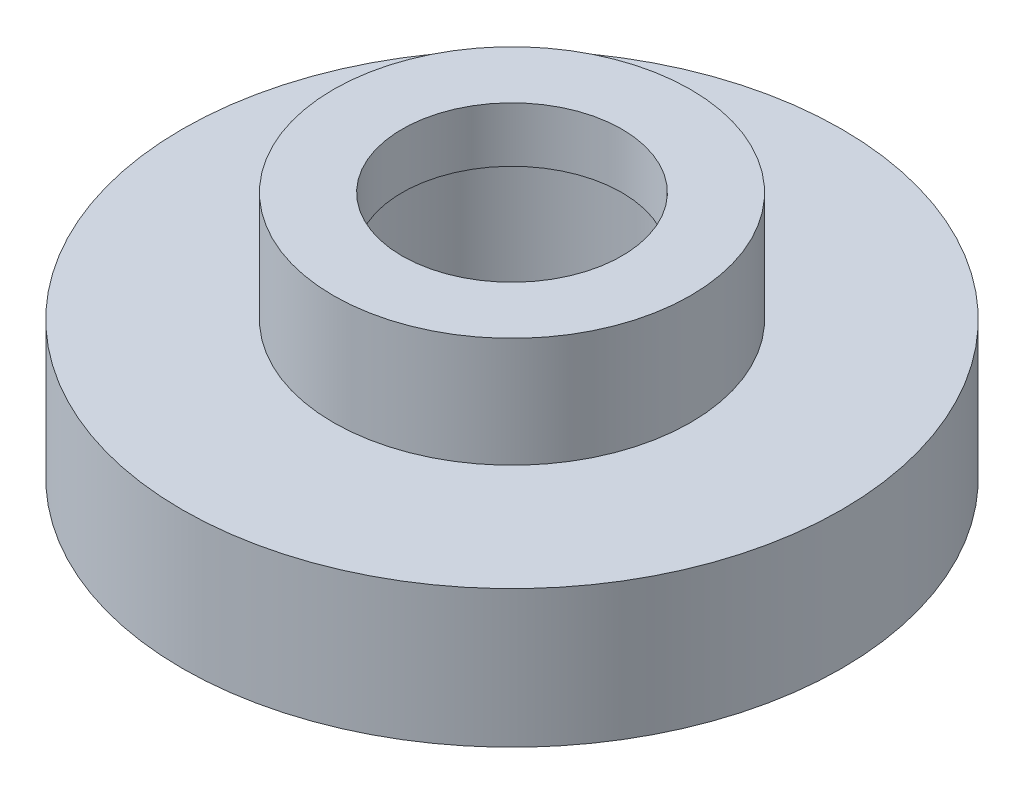
ISO-10303-21;
HEADER;
FILE_DESCRIPTION(('STEP AP214'),'2;1');
FILE_NAME('part.step','',(''),(''),'','','');
FILE_SCHEMA(('AUTOMOTIVE_DESIGN { 1 0 10303 214 1 1 1 1 }'));
ENDSEC;
DATA;
#1=APPLICATION_CONTEXT('core data for automotive mechanical design processes');
#2=APPLICATION_PROTOCOL_DEFINITION('international standard','automotive_design',2000,#1);
#3=PRODUCT_CONTEXT('',#1,'mechanical');
#4=PRODUCT('Part','Part','',(#3));
#5=PRODUCT_RELATED_PRODUCT_CATEGORY('part','',(#4));
#6=PRODUCT_DEFINITION_FORMATION('','',#4);
#7=PRODUCT_DEFINITION_CONTEXT('part definition',#1,'design');
#8=PRODUCT_DEFINITION('design','',#6,#7);
#9=PRODUCT_DEFINITION_SHAPE('','',#8);
#10=(LENGTH_UNIT() NAMED_UNIT(*) SI_UNIT(.MILLI.,.METRE.));
#11=(NAMED_UNIT(*) PLANE_ANGLE_UNIT() SI_UNIT($,.RADIAN.));
#12=(NAMED_UNIT(*) SI_UNIT($,.STERADIAN.) SOLID_ANGLE_UNIT());
#13=UNCERTAINTY_MEASURE_WITH_UNIT(LENGTH_MEASURE(1.E-05),#10,'distance_accuracy_value','');
#14=(GEOMETRIC_REPRESENTATION_CONTEXT(3) GLOBAL_UNCERTAINTY_ASSIGNED_CONTEXT((#13)) GLOBAL_UNIT_ASSIGNED_CONTEXT((#10,
#11,#12)) REPRESENTATION_CONTEXT('',''));
#15=CARTESIAN_POINT('',(0.,0.,0.));
#16=DIRECTION('',(0.,0.,1.));
#17=DIRECTION('',(1.,0.,0.));
#18=AXIS2_PLACEMENT_3D('',#15,#16,#17);
#19=CARTESIAN_POINT('',(0.,5.,0.));
#20=DIRECTION('',(0.,-1.,0.));
#21=DIRECTION('',(0.,0.,-1.));
#22=AXIS2_PLACEMENT_3D('',#19,#20,#21);
#23=CYLINDRICAL_SURFACE('',#22,12.);
#24=CARTESIAN_POINT('',(0.,5.,0.));
#25=DIRECTION('',(0.,1.,0.));
#26=DIRECTION('',(0.,0.,1.));
#27=AXIS2_PLACEMENT_3D('',#24,#25,#26);
#28=CIRCLE('',#27,12.);
#29=CARTESIAN_POINT('',(0.,5.,12.));
#30=VERTEX_POINT('',#29);
#31=EDGE_CURVE('E41',#30,#30,#28,.T.);
#32=ORIENTED_EDGE('',*,*,#31,.F.);
#33=EDGE_LOOP('',(#32));
#34=FACE_BOUND('',#33,.T.);
#35=CARTESIAN_POINT('',(0.,0.,0.));
#36=DIRECTION('',(0.,1.,0.));
#37=DIRECTION('',(0.,0.,1.));
#38=AXIS2_PLACEMENT_3D('',#35,#36,#37);
#39=CIRCLE('',#38,12.);
#40=CARTESIAN_POINT('',(0.,0.,12.));
#41=VERTEX_POINT('',#40);
#42=EDGE_CURVE('E46',#41,#41,#39,.T.);
#43=ORIENTED_EDGE('',*,*,#42,.T.);
#44=EDGE_LOOP('',(#43));
#45=FACE_BOUND('',#44,.T.);
#46=ADVANCED_FACE('F34',(#34,#45),#23,.T.);
#47=CARTESIAN_POINT('',(0.,5.,0.));
#48=DIRECTION('',(0.,1.,0.));
#49=DIRECTION('',(0.,0.,1.));
#50=AXIS2_PLACEMENT_3D('',#47,#48,#49);
#51=PLANE('',#50);
#52=CARTESIAN_POINT('',(0.,5.,0.));
#53=DIRECTION('',(0.,1.,0.));
#54=DIRECTION('',(0.,0.,1.));
#55=AXIS2_PLACEMENT_3D('',#52,#53,#54);
#56=CIRCLE('',#55,6.5);
#57=CARTESIAN_POINT('',(0.,5.,6.5));
#58=VERTEX_POINT('',#57);
#59=EDGE_CURVE('E10',#58,#58,#56,.T.);
#60=ORIENTED_EDGE('',*,*,#59,.F.);
#61=EDGE_LOOP('',(#60));
#62=FACE_BOUND('',#61,.T.);
#63=ORIENTED_EDGE('',*,*,#31,.T.);
#64=EDGE_LOOP('',(#63));
#65=FACE_BOUND('',#64,.T.);
#66=ADVANCED_FACE('F87',(#62,#65),#51,.T.);
#67=CARTESIAN_POINT('',(0.,0.,0.));
#68=DIRECTION('',(0.,1.,0.));
#69=DIRECTION('',(0.,0.,1.));
#70=AXIS2_PLACEMENT_3D('',#67,#68,#69);
#71=PLANE('',#70);
#72=CARTESIAN_POINT('',(0.,0.,0.));
#73=DIRECTION('',(0.,-1.,0.));
#74=DIRECTION('',(0.,0.,-1.));
#75=AXIS2_PLACEMENT_3D('',#72,#73,#74);
#76=CIRCLE('',#75,5.1);
#77=CARTESIAN_POINT('',(0.,0.,-5.1));
#78=VERTEX_POINT('',#77);
#79=EDGE_CURVE('E59',#78,#78,#76,.T.);
#80=ORIENTED_EDGE('',*,*,#79,.F.);
#81=EDGE_LOOP('',(#80));
#82=FACE_BOUND('',#81,.T.);
#83=ORIENTED_EDGE('',*,*,#42,.F.);
#84=EDGE_LOOP('',(#83));
#85=FACE_BOUND('',#84,.T.);
#86=ADVANCED_FACE('F92',(#82,#85),#71,.F.);
#87=CARTESIAN_POINT('',(0.,9.,0.));
#88=DIRECTION('',(0.,-1.,0.));
#89=DIRECTION('',(0.,0.,-1.));
#90=AXIS2_PLACEMENT_3D('',#87,#88,#89);
#91=CYLINDRICAL_SURFACE('',#90,6.5);
#92=CARTESIAN_POINT('',(0.,9.,0.));
#93=DIRECTION('',(0.,1.,0.));
#94=DIRECTION('',(0.,0.,1.));
#95=AXIS2_PLACEMENT_3D('',#92,#93,#94);
#96=CIRCLE('',#95,6.5);
#97=CARTESIAN_POINT('',(0.,9.,6.5));
#98=VERTEX_POINT('',#97);
#99=EDGE_CURVE('E49',#98,#98,#96,.T.);
#100=ORIENTED_EDGE('',*,*,#99,.F.);
#101=EDGE_LOOP('',(#100));
#102=FACE_BOUND('',#101,.T.);
#103=ORIENTED_EDGE('',*,*,#59,.T.);
#104=EDGE_LOOP('',(#103));
#105=FACE_BOUND('',#104,.T.);
#106=ADVANCED_FACE('F100',(#102,#105),#91,.T.);
#107=CARTESIAN_POINT('',(0.,9.,0.));
#108=DIRECTION('',(0.,1.,0.));
#109=DIRECTION('',(0.,0.,1.));
#110=AXIS2_PLACEMENT_3D('',#107,#108,#109);
#111=PLANE('',#110);
#112=CARTESIAN_POINT('',(0.,9.,0.));
#113=DIRECTION('',(0.,1.,0.));
#114=DIRECTION('',(0.,0.,1.));
#115=AXIS2_PLACEMENT_3D('',#112,#113,#114);
#116=CIRCLE('',#115,4.);
#117=CARTESIAN_POINT('',(0.,9.,4.));
#118=VERTEX_POINT('',#117);
#119=EDGE_CURVE('E65',#118,#118,#116,.T.);
#120=ORIENTED_EDGE('',*,*,#119,.F.);
#121=EDGE_LOOP('',(#120));
#122=FACE_BOUND('',#121,.T.);
#123=ORIENTED_EDGE('',*,*,#99,.T.);
#124=EDGE_LOOP('',(#123));
#125=FACE_BOUND('',#124,.T.);
#126=ADVANCED_FACE('F83',(#122,#125),#111,.T.);
#127=CARTESIAN_POINT('',(0.,7.,0.));
#128=DIRECTION('',(0.,-1.,0.));
#129=DIRECTION('',(0.,0.,-1.));
#130=AXIS2_PLACEMENT_3D('',#127,#128,#129);
#131=CYLINDRICAL_SURFACE('',#130,5.1);
#132=CARTESIAN_POINT('',(0.,7.,0.));
#133=DIRECTION('',(0.,-1.,0.));
#134=DIRECTION('',(0.,0.,-1.));
#135=AXIS2_PLACEMENT_3D('',#132,#133,#134);
#136=CIRCLE('',#135,5.1);
#137=CARTESIAN_POINT('',(0.,7.,-5.1));
#138=VERTEX_POINT('',#137);
#139=EDGE_CURVE('E55',#138,#138,#136,.T.);
#140=ORIENTED_EDGE('',*,*,#139,.F.);
#141=EDGE_LOOP('',(#140));
#142=FACE_BOUND('',#141,.T.);
#143=ORIENTED_EDGE('',*,*,#79,.T.);
#144=EDGE_LOOP('',(#143));
#145=FACE_BOUND('',#144,.T.);
#146=ADVANCED_FACE('F76',(#142,#145),#131,.F.);
#147=CARTESIAN_POINT('',(0.,7.,0.));
#148=DIRECTION('',(0.,-1.,0.));
#149=DIRECTION('',(0.,0.,-1.));
#150=AXIS2_PLACEMENT_3D('',#147,#148,#149);
#151=PLANE('',#150);
#152=CARTESIAN_POINT('',(0.,7.,0.));
#153=DIRECTION('',(0.,-1.,0.));
#154=DIRECTION('',(0.,0.,-1.));
#155=AXIS2_PLACEMENT_3D('',#152,#153,#154);
#156=CIRCLE('',#155,4.);
#157=CARTESIAN_POINT('',(0.,7.,-4.));
#158=VERTEX_POINT('',#157);
#159=EDGE_CURVE('E37',#158,#158,#156,.T.);
#160=ORIENTED_EDGE('',*,*,#159,.F.);
#161=EDGE_LOOP('',(#160));
#162=FACE_BOUND('',#161,.T.);
#163=ORIENTED_EDGE('',*,*,#139,.T.);
#164=EDGE_LOOP('',(#163));
#165=FACE_BOUND('',#164,.T.);
#166=ADVANCED_FACE('F74',(#162,#165),#151,.T.);
#167=CARTESIAN_POINT('',(0.,2.,0.));
#168=DIRECTION('',(0.,1.,0.));
#169=DIRECTION('',(0.,0.,1.));
#170=AXIS2_PLACEMENT_3D('',#167,#168,#169);
#171=CYLINDRICAL_SURFACE('',#170,4.);
#172=ORIENTED_EDGE('',*,*,#159,.T.);
#173=EDGE_LOOP('',(#172));
#174=FACE_BOUND('',#173,.T.);
#175=ORIENTED_EDGE('',*,*,#119,.T.);
#176=EDGE_LOOP('',(#175));
#177=FACE_BOUND('',#176,.T.);
#178=ADVANCED_FACE('F72',(#174,#177),#171,.F.);
#179=CLOSED_SHELL('',(#46,#66,#86,#106,#126,#146,#166,#178));
#180=MANIFOLD_SOLID_BREP('B2',#179);
#181=ADVANCED_BREP_SHAPE_REPRESENTATION('',(#18,#180),#14);
#182=SHAPE_DEFINITION_REPRESENTATION(#9,#181);
ENDSEC;
END-ISO-10303-21;
